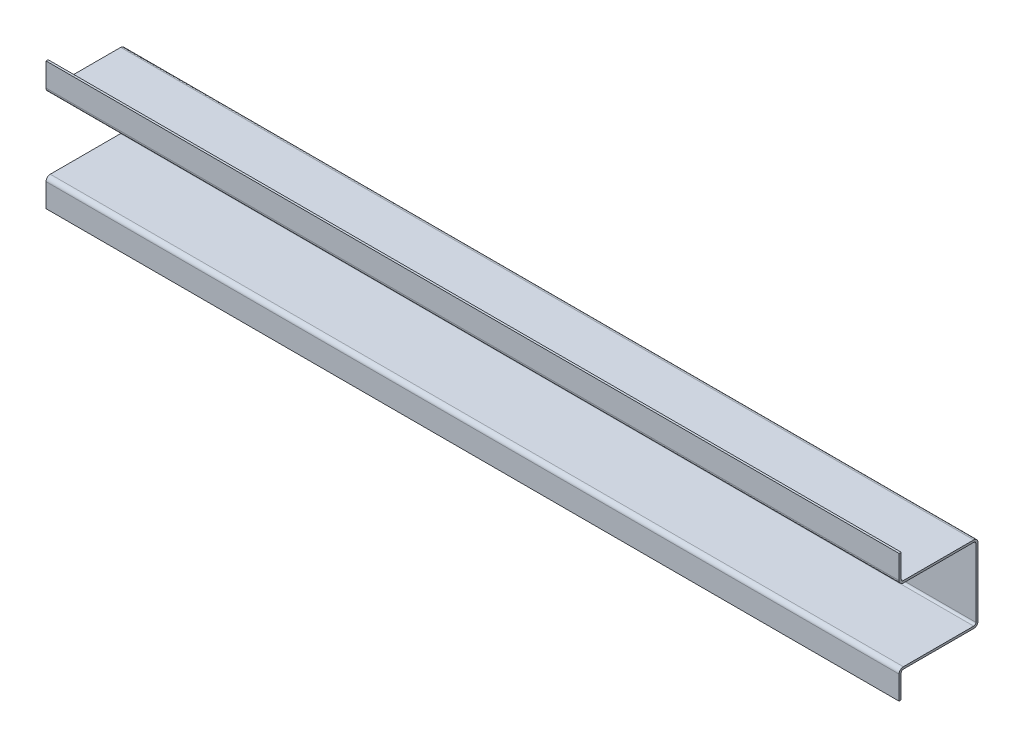
ISO-10303-21;
HEADER;
FILE_DESCRIPTION(('STEP AP214'),'2;1');
FILE_NAME('part.step','',(''),(''),'','','');
FILE_SCHEMA(('AUTOMOTIVE_DESIGN { 1 0 10303 214 1 1 1 1 }'));
ENDSEC;
DATA;
#1=APPLICATION_CONTEXT('core data for automotive mechanical design processes');
#2=APPLICATION_PROTOCOL_DEFINITION('international standard','automotive_design',2000,#1);
#3=PRODUCT_CONTEXT('',#1,'mechanical');
#4=PRODUCT('Part','Part','',(#3));
#5=PRODUCT_RELATED_PRODUCT_CATEGORY('part','',(#4));
#6=PRODUCT_DEFINITION_FORMATION('','',#4);
#7=PRODUCT_DEFINITION_CONTEXT('part definition',#1,'design');
#8=PRODUCT_DEFINITION('design','',#6,#7);
#9=PRODUCT_DEFINITION_SHAPE('','',#8);
#10=(LENGTH_UNIT() NAMED_UNIT(*) SI_UNIT(.MILLI.,.METRE.));
#11=(NAMED_UNIT(*) PLANE_ANGLE_UNIT() SI_UNIT($,.RADIAN.));
#12=(NAMED_UNIT(*) SI_UNIT($,.STERADIAN.) SOLID_ANGLE_UNIT());
#13=UNCERTAINTY_MEASURE_WITH_UNIT(LENGTH_MEASURE(1.E-05),#10,'distance_accuracy_value','');
#14=(GEOMETRIC_REPRESENTATION_CONTEXT(3) GLOBAL_UNCERTAINTY_ASSIGNED_CONTEXT((#13)) GLOBAL_UNIT_ASSIGNED_CONTEXT((#10,
#11,#12)) REPRESENTATION_CONTEXT('',''));
#15=CARTESIAN_POINT('',(0.,0.,0.));
#16=DIRECTION('',(0.,0.,1.));
#17=DIRECTION('',(1.,0.,0.));
#18=AXIS2_PLACEMENT_3D('',#15,#16,#17);
#19=CARTESIAN_POINT('',(-635.,-92.075,3.175));
#20=DIRECTION('',(0.,0.,-1.));
#21=DIRECTION('',(-1.,0.,0.));
#22=AXIS2_PLACEMENT_3D('',#19,#20,#21);
#23=PLANE('',#22);
#24=DIRECTION('',(0.,1.,0.));
#25=VECTOR('',#24,1.);
#26=CARTESIAN_POINT('',(635.,-72.23125,3.175));
#27=LINE('',#26,#25);
#28=CARTESIAN_POINT('',(635.,-92.075,3.175));
#29=VERTEX_POINT('',#28);
#30=CARTESIAN_POINT('',(635.,-57.15,3.175));
#31=VERTEX_POINT('',#30);
#32=EDGE_CURVE('E183',#29,#31,#27,.T.);
#33=ORIENTED_EDGE('',*,*,#32,.T.);
#34=DIRECTION('',(1.,0.,0.));
#35=VECTOR('',#34,1.);
#36=CARTESIAN_POINT('',(-635.,-57.15,3.175));
#37=LINE('',#36,#35);
#38=CARTESIAN_POINT('',(-635.,-57.15,3.175));
#39=VERTEX_POINT('',#38);
#40=EDGE_CURVE('E136',#39,#31,#37,.T.);
#41=ORIENTED_EDGE('',*,*,#40,.F.);
#42=DIRECTION('',(0.,1.,0.));
#43=VECTOR('',#42,1.);
#44=CARTESIAN_POINT('',(-635.,-72.23125,3.175));
#45=LINE('',#44,#43);
#46=CARTESIAN_POINT('',(-635.,-92.075,3.175));
#47=VERTEX_POINT('',#46);
#48=EDGE_CURVE('E176',#47,#39,#45,.T.);
#49=ORIENTED_EDGE('',*,*,#48,.F.);
#50=DIRECTION('',(1.,0.,0.));
#51=VECTOR('',#50,1.);
#52=CARTESIAN_POINT('',(0.,-92.075,3.175));
#53=LINE('',#52,#51);
#54=EDGE_CURVE('E199',#47,#29,#53,.T.);
#55=ORIENTED_EDGE('',*,*,#54,.T.);
#56=EDGE_LOOP('',(#33,#41,#49,#55));
#57=FACE_BOUND('',#56,.T.);
#58=ADVANCED_FACE('F17',(#57),#23,.F.);
#59=CARTESIAN_POINT('',(0.,-92.075,1.5875));
#60=DIRECTION('',(0.,1.,0.));
#61=DIRECTION('',(0.,0.,1.));
#62=AXIS2_PLACEMENT_3D('',#59,#60,#61);
#63=PLANE('',#62);
#64=ORIENTED_EDGE('',*,*,#54,.F.);
#65=DIRECTION('',(0.,0.,1.));
#66=VECTOR('',#65,1.);
#67=CARTESIAN_POINT('',(-635.,-92.075,1.5875));
#68=LINE('',#67,#66);
#69=CARTESIAN_POINT('',(-635.,-92.075,0.));
#70=VERTEX_POINT('',#69);
#71=EDGE_CURVE('E179',#70,#47,#68,.T.);
#72=ORIENTED_EDGE('',*,*,#71,.F.);
#73=DIRECTION('',(-1.,0.,0.));
#74=VECTOR('',#73,1.);
#75=CARTESIAN_POINT('',(-635.,-92.075,0.));
#76=LINE('',#75,#74);
#77=CARTESIAN_POINT('',(635.,-92.075,0.));
#78=VERTEX_POINT('',#77);
#79=EDGE_CURVE('E169',#78,#70,#76,.T.);
#80=ORIENTED_EDGE('',*,*,#79,.F.);
#81=DIRECTION('',(0.,0.,1.));
#82=VECTOR('',#81,1.);
#83=CARTESIAN_POINT('',(635.,-92.075,1.5875));
#84=LINE('',#83,#82);
#85=EDGE_CURVE('E186',#78,#29,#84,.T.);
#86=ORIENTED_EDGE('',*,*,#85,.T.);
#87=EDGE_LOOP('',(#64,#72,#80,#86));
#88=FACE_BOUND('',#87,.T.);
#89=ADVANCED_FACE('F411',(#88),#63,.F.);
#90=CARTESIAN_POINT('',(-635.,-57.15,-3.175));
#91=DIRECTION('',(1.,0.,0.));
#92=DIRECTION('',(0.,0.,-1.));
#93=AXIS2_PLACEMENT_3D('',#90,#91,#92);
#94=CYLINDRICAL_SURFACE('',#93,6.35);
#95=CARTESIAN_POINT('',(635.,-57.15,-3.175));
#96=DIRECTION('',(1.,0.,0.));
#97=DIRECTION('',(0.,0.,-1.));
#98=AXIS2_PLACEMENT_3D('',#95,#96,#97);
#99=CIRCLE('',#98,6.35);
#100=CARTESIAN_POINT('',(635.,-50.8,-3.175));
#101=VERTEX_POINT('',#100);
#102=EDGE_CURVE('E20',#101,#31,#99,.T.);
#103=ORIENTED_EDGE('',*,*,#102,.F.);
#104=DIRECTION('',(1.,0.,0.));
#105=VECTOR('',#104,1.);
#106=CARTESIAN_POINT('',(-635.,-50.8,-3.175));
#107=LINE('',#106,#105);
#108=CARTESIAN_POINT('',(-635.,-50.8,-3.175));
#109=VERTEX_POINT('',#108);
#110=EDGE_CURVE('E134',#101,#109,#107,.F.);
#111=ORIENTED_EDGE('',*,*,#110,.T.);
#112=CARTESIAN_POINT('',(-635.,-57.15,-3.175));
#113=DIRECTION('',(1.,0.,0.));
#114=DIRECTION('',(0.,0.,-1.));
#115=AXIS2_PLACEMENT_3D('',#112,#113,#114);
#116=CIRCLE('',#115,6.35);
#117=EDGE_CURVE('E140',#109,#39,#116,.T.);
#118=ORIENTED_EDGE('',*,*,#117,.T.);
#119=ORIENTED_EDGE('',*,*,#40,.T.);
#120=EDGE_LOOP('',(#103,#111,#118,#119));
#121=FACE_BOUND('',#120,.T.);
#122=ADVANCED_FACE('F132',(#121),#94,.T.);
#123=CARTESIAN_POINT('',(-635.,-92.075,0.));
#124=DIRECTION('',(0.,0.,-1.));
#125=DIRECTION('',(-1.,0.,0.));
#126=AXIS2_PLACEMENT_3D('',#123,#124,#125);
#127=PLANE('',#126);
#128=ORIENTED_EDGE('',*,*,#79,.T.);
#129=DIRECTION('',(0.,1.,0.));
#130=VECTOR('',#129,1.);
#131=CARTESIAN_POINT('',(-635.,-92.075,0.));
#132=LINE('',#131,#130);
#133=CARTESIAN_POINT('',(-635.,-57.15,0.));
#134=VERTEX_POINT('',#133);
#135=EDGE_CURVE('E141',#70,#134,#132,.T.);
#136=ORIENTED_EDGE('',*,*,#135,.T.);
#137=DIRECTION('',(1.,0.,0.));
#138=VECTOR('',#137,1.);
#139=CARTESIAN_POINT('',(-635.,-57.15,0.));
#140=LINE('',#139,#138);
#141=CARTESIAN_POINT('',(635.,-57.15,0.));
#142=VERTEX_POINT('',#141);
#143=EDGE_CURVE('E157',#134,#142,#140,.T.);
#144=ORIENTED_EDGE('',*,*,#143,.T.);
#145=DIRECTION('',(0.,1.,0.));
#146=VECTOR('',#145,1.);
#147=CARTESIAN_POINT('',(635.,-92.075,0.));
#148=LINE('',#147,#146);
#149=EDGE_CURVE('E166',#142,#78,#148,.F.);
#150=ORIENTED_EDGE('',*,*,#149,.T.);
#151=EDGE_LOOP('',(#128,#136,#144,#150));
#152=FACE_BOUND('',#151,.T.);
#153=ADVANCED_FACE('F409',(#152),#127,.T.);
#154=CARTESIAN_POINT('',(-635.,-50.8,0.));
#155=DIRECTION('',(0.,-1.,0.));
#156=DIRECTION('',(0.,0.,-1.));
#157=AXIS2_PLACEMENT_3D('',#154,#155,#156);
#158=PLANE('',#157);
#159=DIRECTION('',(0.,0.,1.));
#160=VECTOR('',#159,1.);
#161=CARTESIAN_POINT('',(635.,-50.8,-55.5625));
#162=LINE('',#161,#160);
#163=CARTESIAN_POINT('',(635.,-50.8,-107.95));
#164=VERTEX_POINT('',#163);
#165=EDGE_CURVE('E145',#101,#164,#162,.F.);
#166=ORIENTED_EDGE('',*,*,#165,.T.);
#167=DIRECTION('',(-1.,0.,0.));
#168=VECTOR('',#167,1.);
#169=CARTESIAN_POINT('',(-635.,-50.8,-107.95));
#170=LINE('',#169,#168);
#171=CARTESIAN_POINT('',(-635.,-50.8,-107.95));
#172=VERTEX_POINT('',#171);
#173=EDGE_CURVE('E250',#164,#172,#170,.T.);
#174=ORIENTED_EDGE('',*,*,#173,.T.);
#175=DIRECTION('',(0.,0.,1.));
#176=VECTOR('',#175,1.);
#177=CARTESIAN_POINT('',(-635.,-50.8,-55.5625));
#178=LINE('',#177,#176);
#179=EDGE_CURVE('E148',#109,#172,#178,.F.);
#180=ORIENTED_EDGE('',*,*,#179,.F.);
#181=ORIENTED_EDGE('',*,*,#110,.F.);
#182=EDGE_LOOP('',(#166,#174,#180,#181));
#183=FACE_BOUND('',#182,.T.);
#184=ADVANCED_FACE('F144',(#183),#158,.F.);
#185=CARTESIAN_POINT('',(-635.,-57.15,-3.175));
#186=DIRECTION('',(1.,0.,0.));
#187=DIRECTION('',(0.,0.,-1.));
#188=AXIS2_PLACEMENT_3D('',#185,#186,#187);
#189=CYLINDRICAL_SURFACE('',#188,3.175);
#190=ORIENTED_EDGE('',*,*,#143,.F.);
#191=CARTESIAN_POINT('',(-635.,-57.15,-3.175));
#192=DIRECTION('',(1.,0.,0.));
#193=DIRECTION('',(0.,0.,-1.));
#194=AXIS2_PLACEMENT_3D('',#191,#192,#193);
#195=CIRCLE('',#194,3.175);
#196=CARTESIAN_POINT('',(-635.,-53.975,-3.175));
#197=VERTEX_POINT('',#196);
#198=EDGE_CURVE('E155',#197,#134,#195,.T.);
#199=ORIENTED_EDGE('',*,*,#198,.F.);
#200=DIRECTION('',(1.,0.,0.));
#201=VECTOR('',#200,1.);
#202=CARTESIAN_POINT('',(-635.,-53.975,-3.175));
#203=LINE('',#202,#201);
#204=CARTESIAN_POINT('',(635.,-53.975,-3.175));
#205=VERTEX_POINT('',#204);
#206=EDGE_CURVE('E160',#205,#197,#203,.F.);
#207=ORIENTED_EDGE('',*,*,#206,.F.);
#208=CARTESIAN_POINT('',(635.,-57.15,-3.175));
#209=DIRECTION('',(1.,0.,0.));
#210=DIRECTION('',(0.,0.,-1.));
#211=AXIS2_PLACEMENT_3D('',#208,#209,#210);
#212=CIRCLE('',#211,3.175);
#213=EDGE_CURVE('E165',#142,#205,#212,.F.);
#214=ORIENTED_EDGE('',*,*,#213,.F.);
#215=EDGE_LOOP('',(#190,#199,#207,#214));
#216=FACE_BOUND('',#215,.T.);
#217=ADVANCED_FACE('F407',(#216),#189,.F.);
#218=CARTESIAN_POINT('',(-635.,-47.625,-107.95));
#219=DIRECTION('',(-1.,0.,0.));
#220=DIRECTION('',(0.,0.,1.));
#221=AXIS2_PLACEMENT_3D('',#218,#219,#220);
#222=CYLINDRICAL_SURFACE('',#221,3.175);
#223=ORIENTED_EDGE('',*,*,#173,.F.);
#224=CARTESIAN_POINT('',(635.,-47.625,-107.95));
#225=DIRECTION('',(-1.,0.,0.));
#226=DIRECTION('',(0.,0.,1.));
#227=AXIS2_PLACEMENT_3D('',#224,#225,#226);
#228=CIRCLE('',#227,3.175);
#229=CARTESIAN_POINT('',(635.,-47.625,-111.125));
#230=VERTEX_POINT('',#229);
#231=EDGE_CURVE('E154',#230,#164,#228,.T.);
#232=ORIENTED_EDGE('',*,*,#231,.F.);
#233=DIRECTION('',(-1.,0.,0.));
#234=VECTOR('',#233,1.);
#235=CARTESIAN_POINT('',(-635.,-47.625,-111.125));
#236=LINE('',#235,#234);
#237=CARTESIAN_POINT('',(-635.,-47.625,-111.125));
#238=VERTEX_POINT('',#237);
#239=EDGE_CURVE('E246',#230,#238,#236,.T.);
#240=ORIENTED_EDGE('',*,*,#239,.T.);
#241=CARTESIAN_POINT('',(-635.,-47.625,-107.95));
#242=DIRECTION('',(-1.,0.,0.));
#243=DIRECTION('',(0.,0.,1.));
#244=AXIS2_PLACEMENT_3D('',#241,#242,#243);
#245=CIRCLE('',#244,3.175);
#246=EDGE_CURVE('E243',#238,#172,#245,.T.);
#247=ORIENTED_EDGE('',*,*,#246,.T.);
#248=EDGE_LOOP('',(#223,#232,#240,#247));
#249=FACE_BOUND('',#248,.T.);
#250=ADVANCED_FACE('F344',(#249),#222,.F.);
#251=CARTESIAN_POINT('',(-635.,-53.975,0.));
#252=DIRECTION('',(0.,-1.,0.));
#253=DIRECTION('',(0.,0.,-1.));
#254=AXIS2_PLACEMENT_3D('',#251,#252,#253);
#255=PLANE('',#254);
#256=ORIENTED_EDGE('',*,*,#206,.T.);
#257=DIRECTION('',(0.,0.,-1.));
#258=VECTOR('',#257,1.);
#259=CARTESIAN_POINT('',(-635.,-53.975,0.));
#260=LINE('',#259,#258);
#261=CARTESIAN_POINT('',(-635.,-53.975,-107.95));
#262=VERTEX_POINT('',#261);
#263=EDGE_CURVE('E247',#197,#262,#260,.T.);
#264=ORIENTED_EDGE('',*,*,#263,.T.);
#265=DIRECTION('',(-1.,0.,0.));
#266=VECTOR('',#265,1.);
#267=CARTESIAN_POINT('',(-635.,-53.975,-107.95));
#268=LINE('',#267,#266);
#269=CARTESIAN_POINT('',(635.,-53.975,-107.95));
#270=VERTEX_POINT('',#269);
#271=EDGE_CURVE('E238',#270,#262,#268,.T.);
#272=ORIENTED_EDGE('',*,*,#271,.F.);
#273=DIRECTION('',(0.,0.,-1.));
#274=VECTOR('',#273,1.);
#275=CARTESIAN_POINT('',(635.,-53.975,0.));
#276=LINE('',#275,#274);
#277=EDGE_CURVE('E249',#270,#205,#276,.F.);
#278=ORIENTED_EDGE('',*,*,#277,.T.);
#279=EDGE_LOOP('',(#256,#264,#272,#278));
#280=FACE_BOUND('',#279,.T.);
#281=ADVANCED_FACE('F402',(#280),#255,.T.);
#282=CARTESIAN_POINT('',(-635.,-53.975,-111.125));
#283=DIRECTION('',(0.,0.,-1.));
#284=DIRECTION('',(-1.,0.,0.));
#285=AXIS2_PLACEMENT_3D('',#282,#283,#284);
#286=PLANE('',#285);
#287=DIRECTION('',(0.,1.,0.));
#288=VECTOR('',#287,1.);
#289=CARTESIAN_POINT('',(635.,3.175,-111.125));
#290=LINE('',#289,#288);
#291=CARTESIAN_POINT('',(635.,53.975,-111.125));
#292=VERTEX_POINT('',#291);
#293=EDGE_CURVE('E242',#230,#292,#290,.T.);
#294=ORIENTED_EDGE('',*,*,#293,.T.);
#295=DIRECTION('',(-1.,0.,0.));
#296=VECTOR('',#295,1.);
#297=CARTESIAN_POINT('',(-635.,53.975,-111.125));
#298=LINE('',#297,#296);
#299=CARTESIAN_POINT('',(-635.,53.975,-111.125));
#300=VERTEX_POINT('',#299);
#301=EDGE_CURVE('E311',#292,#300,#298,.T.);
#302=ORIENTED_EDGE('',*,*,#301,.T.);
#303=DIRECTION('',(0.,1.,0.));
#304=VECTOR('',#303,1.);
#305=CARTESIAN_POINT('',(-635.,3.175,-111.125));
#306=LINE('',#305,#304);
#307=EDGE_CURVE('E237',#238,#300,#306,.T.);
#308=ORIENTED_EDGE('',*,*,#307,.F.);
#309=ORIENTED_EDGE('',*,*,#239,.F.);
#310=EDGE_LOOP('',(#294,#302,#308,#309));
#311=FACE_BOUND('',#310,.T.);
#312=ADVANCED_FACE('F349',(#311),#286,.F.);
#313=CARTESIAN_POINT('',(-635.,60.325,3.175));
#314=DIRECTION('',(0.,0.,-1.));
#315=DIRECTION('',(-1.,0.,0.));
#316=AXIS2_PLACEMENT_3D('',#313,#314,#315);
#317=PLANE('',#316);
#318=DIRECTION('',(0.,1.,0.));
#319=VECTOR('',#318,1.);
#320=CARTESIAN_POINT('',(635.,78.58125,3.175));
#321=LINE('',#320,#319);
#322=CARTESIAN_POINT('',(635.,63.5,3.175));
#323=VERTEX_POINT('',#322);
#324=CARTESIAN_POINT('',(635.,98.425,3.175));
#325=VERTEX_POINT('',#324);
#326=EDGE_CURVE('E321',#323,#325,#321,.T.);
#327=ORIENTED_EDGE('',*,*,#326,.T.);
#328=DIRECTION('',(1.,0.,0.));
#329=VECTOR('',#328,1.);
#330=CARTESIAN_POINT('',(0.,98.425,3.175));
#331=LINE('',#330,#329);
#332=CARTESIAN_POINT('',(-635.,98.425,3.175));
#333=VERTEX_POINT('',#332);
#334=EDGE_CURVE('E323',#333,#325,#331,.T.);
#335=ORIENTED_EDGE('',*,*,#334,.F.);
#336=DIRECTION('',(0.,1.,0.));
#337=VECTOR('',#336,1.);
#338=CARTESIAN_POINT('',(-635.,78.58125,3.175));
#339=LINE('',#338,#337);
#340=CARTESIAN_POINT('',(-635.,63.5,3.175));
#341=VERTEX_POINT('',#340);
#342=EDGE_CURVE('E296',#341,#333,#339,.T.);
#343=ORIENTED_EDGE('',*,*,#342,.F.);
#344=DIRECTION('',(1.,0.,0.));
#345=VECTOR('',#344,1.);
#346=CARTESIAN_POINT('',(-635.,63.5,3.175));
#347=LINE('',#346,#345);
#348=EDGE_CURVE('E292',#323,#341,#347,.F.);
#349=ORIENTED_EDGE('',*,*,#348,.F.);
#350=EDGE_LOOP('',(#327,#335,#343,#349));
#351=FACE_BOUND('',#350,.T.);
#352=ADVANCED_FACE('F383',(#351),#317,.F.);
#353=CARTESIAN_POINT('',(0.,98.425,1.5875));
#354=DIRECTION('',(0.,1.,0.));
#355=DIRECTION('',(0.,0.,1.));
#356=AXIS2_PLACEMENT_3D('',#353,#354,#355);
#357=PLANE('',#356);
#358=DIRECTION('',(0.,0.,1.));
#359=VECTOR('',#358,1.);
#360=CARTESIAN_POINT('',(635.,98.425,1.5875));
#361=LINE('',#360,#359);
#362=CARTESIAN_POINT('',(635.,98.425,0.));
#363=VERTEX_POINT('',#362);
#364=EDGE_CURVE('E287',#325,#363,#361,.F.);
#365=ORIENTED_EDGE('',*,*,#364,.T.);
#366=DIRECTION('',(-1.,0.,0.));
#367=VECTOR('',#366,1.);
#368=CARTESIAN_POINT('',(-635.,98.425,0.));
#369=LINE('',#368,#367);
#370=CARTESIAN_POINT('',(-635.,98.425,0.));
#371=VERTEX_POINT('',#370);
#372=EDGE_CURVE('E280',#371,#363,#369,.F.);
#373=ORIENTED_EDGE('',*,*,#372,.F.);
#374=DIRECTION('',(0.,0.,1.));
#375=VECTOR('',#374,1.);
#376=CARTESIAN_POINT('',(-635.,98.425,1.5875));
#377=LINE('',#376,#375);
#378=EDGE_CURVE('E284',#333,#371,#377,.F.);
#379=ORIENTED_EDGE('',*,*,#378,.F.);
#380=ORIENTED_EDGE('',*,*,#334,.T.);
#381=EDGE_LOOP('',(#365,#373,#379,#380));
#382=FACE_BOUND('',#381,.T.);
#383=ADVANCED_FACE('F282',(#382),#357,.T.);
#384=CARTESIAN_POINT('',(-635.,-47.625,-107.95));
#385=DIRECTION('',(-1.,0.,0.));
#386=DIRECTION('',(0.,0.,1.));
#387=AXIS2_PLACEMENT_3D('',#384,#385,#386);
#388=CYLINDRICAL_SURFACE('',#387,6.35);
#389=CARTESIAN_POINT('',(-635.,-47.625,-107.95));
#390=DIRECTION('',(-1.,0.,0.));
#391=DIRECTION('',(0.,0.,1.));
#392=AXIS2_PLACEMENT_3D('',#389,#390,#391);
#393=CIRCLE('',#392,6.35);
#394=CARTESIAN_POINT('',(-635.,-47.625,-114.3));
#395=VERTEX_POINT('',#394);
#396=EDGE_CURVE('E235',#262,#395,#393,.F.);
#397=ORIENTED_EDGE('',*,*,#396,.T.);
#398=DIRECTION('',(-1.,0.,0.));
#399=VECTOR('',#398,1.);
#400=CARTESIAN_POINT('',(-635.,-47.625,-114.3));
#401=LINE('',#400,#399);
#402=CARTESIAN_POINT('',(635.,-47.625,-114.3));
#403=VERTEX_POINT('',#402);
#404=EDGE_CURVE('E317',#403,#395,#401,.T.);
#405=ORIENTED_EDGE('',*,*,#404,.F.);
#406=CARTESIAN_POINT('',(635.,-47.625,-107.95));
#407=DIRECTION('',(-1.,0.,0.));
#408=DIRECTION('',(0.,0.,1.));
#409=AXIS2_PLACEMENT_3D('',#406,#407,#408);
#410=CIRCLE('',#409,6.35);
#411=EDGE_CURVE('E239',#403,#270,#410,.T.);
#412=ORIENTED_EDGE('',*,*,#411,.T.);
#413=ORIENTED_EDGE('',*,*,#271,.T.);
#414=EDGE_LOOP('',(#397,#405,#412,#413));
#415=FACE_BOUND('',#414,.T.);
#416=ADVANCED_FACE('F400',(#415),#388,.T.);
#417=CARTESIAN_POINT('',(-635.,53.975,-107.95));
#418=DIRECTION('',(-1.,0.,0.));
#419=DIRECTION('',(0.,0.,1.));
#420=AXIS2_PLACEMENT_3D('',#417,#418,#419);
#421=CYLINDRICAL_SURFACE('',#420,3.175);
#422=ORIENTED_EDGE('',*,*,#301,.F.);
#423=CARTESIAN_POINT('',(635.,53.975,-107.95));
#424=DIRECTION('',(-1.,0.,0.));
#425=DIRECTION('',(0.,0.,1.));
#426=AXIS2_PLACEMENT_3D('',#423,#424,#425);
#427=CIRCLE('',#426,3.175);
#428=CARTESIAN_POINT('',(635.,57.15,-107.95));
#429=VERTEX_POINT('',#428);
#430=EDGE_CURVE('E227',#429,#292,#427,.T.);
#431=ORIENTED_EDGE('',*,*,#430,.F.);
#432=DIRECTION('',(1.,0.,0.));
#433=VECTOR('',#432,1.);
#434=CARTESIAN_POINT('',(-635.,57.15,-107.95));
#435=LINE('',#434,#433);
#436=CARTESIAN_POINT('',(-635.,57.15,-107.95));
#437=VERTEX_POINT('',#436);
#438=EDGE_CURVE('E221',#429,#437,#435,.F.);
#439=ORIENTED_EDGE('',*,*,#438,.T.);
#440=CARTESIAN_POINT('',(-635.,53.975,-107.95));
#441=DIRECTION('',(-1.,0.,0.));
#442=DIRECTION('',(0.,0.,1.));
#443=AXIS2_PLACEMENT_3D('',#440,#441,#442);
#444=CIRCLE('',#443,3.175);
#445=EDGE_CURVE('E222',#437,#300,#444,.T.);
#446=ORIENTED_EDGE('',*,*,#445,.T.);
#447=EDGE_LOOP('',(#422,#431,#439,#446));
#448=FACE_BOUND('',#447,.T.);
#449=ADVANCED_FACE('F352',(#448),#421,.F.);
#450=CARTESIAN_POINT('',(-635.,63.5,-3.175));
#451=DIRECTION('',(1.,0.,0.));
#452=DIRECTION('',(0.,0.,-1.));
#453=AXIS2_PLACEMENT_3D('',#450,#451,#452);
#454=CYLINDRICAL_SURFACE('',#453,6.35);
#455=CARTESIAN_POINT('',(635.,63.5,-3.175));
#456=DIRECTION('',(1.,0.,0.));
#457=DIRECTION('',(0.,0.,-1.));
#458=AXIS2_PLACEMENT_3D('',#455,#456,#457);
#459=CIRCLE('',#458,6.35);
#460=CARTESIAN_POINT('',(635.,57.15,-3.175));
#461=VERTEX_POINT('',#460);
#462=EDGE_CURVE('E231',#323,#461,#459,.T.);
#463=ORIENTED_EDGE('',*,*,#462,.F.);
#464=ORIENTED_EDGE('',*,*,#348,.T.);
#465=CARTESIAN_POINT('',(-635.,63.5,-3.175));
#466=DIRECTION('',(1.,0.,0.));
#467=DIRECTION('',(0.,0.,-1.));
#468=AXIS2_PLACEMENT_3D('',#465,#466,#467);
#469=CIRCLE('',#468,6.35);
#470=CARTESIAN_POINT('',(-635.,57.15,-3.175));
#471=VERTEX_POINT('',#470);
#472=EDGE_CURVE('E219',#341,#471,#469,.T.);
#473=ORIENTED_EDGE('',*,*,#472,.T.);
#474=DIRECTION('',(1.,0.,0.));
#475=VECTOR('',#474,1.);
#476=CARTESIAN_POINT('',(-635.,57.15,-3.175));
#477=LINE('',#476,#475);
#478=EDGE_CURVE('E225',#471,#461,#477,.T.);
#479=ORIENTED_EDGE('',*,*,#478,.T.);
#480=EDGE_LOOP('',(#463,#464,#473,#479));
#481=FACE_BOUND('',#480,.T.);
#482=ADVANCED_FACE('F381',(#481),#454,.T.);
#483=CARTESIAN_POINT('',(-635.,60.325,0.));
#484=DIRECTION('',(0.,0.,-1.));
#485=DIRECTION('',(-1.,0.,0.));
#486=AXIS2_PLACEMENT_3D('',#483,#484,#485);
#487=PLANE('',#486);
#488=DIRECTION('',(1.,0.,0.));
#489=VECTOR('',#488,1.);
#490=CARTESIAN_POINT('',(-635.,63.5,0.));
#491=LINE('',#490,#489);
#492=CARTESIAN_POINT('',(635.,63.5,0.));
#493=VERTEX_POINT('',#492);
#494=CARTESIAN_POINT('',(-635.,63.5,0.));
#495=VERTEX_POINT('',#494);
#496=EDGE_CURVE('E218',#493,#495,#491,.F.);
#497=ORIENTED_EDGE('',*,*,#496,.T.);
#498=DIRECTION('',(0.,1.,0.));
#499=VECTOR('',#498,1.);
#500=CARTESIAN_POINT('',(-635.,60.325,0.));
#501=LINE('',#500,#499);
#502=EDGE_CURVE('E234',#495,#371,#501,.T.);
#503=ORIENTED_EDGE('',*,*,#502,.T.);
#504=ORIENTED_EDGE('',*,*,#372,.T.);
#505=DIRECTION('',(0.,1.,0.));
#506=VECTOR('',#505,1.);
#507=CARTESIAN_POINT('',(635.,60.325,0.));
#508=LINE('',#507,#506);
#509=EDGE_CURVE('E291',#363,#493,#508,.F.);
#510=ORIENTED_EDGE('',*,*,#509,.T.);
#511=EDGE_LOOP('',(#497,#503,#504,#510));
#512=FACE_BOUND('',#511,.T.);
#513=ADVANCED_FACE('F298',(#512),#487,.T.);
#514=CARTESIAN_POINT('',(-635.,-53.975,-114.3));
#515=DIRECTION('',(0.,0.,-1.));
#516=DIRECTION('',(-1.,0.,0.));
#517=AXIS2_PLACEMENT_3D('',#514,#515,#516);
#518=PLANE('',#517);
#519=ORIENTED_EDGE('',*,*,#404,.T.);
#520=DIRECTION('',(0.,1.,0.));
#521=VECTOR('',#520,1.);
#522=CARTESIAN_POINT('',(-635.,-53.975,-114.3));
#523=LINE('',#522,#521);
#524=CARTESIAN_POINT('',(-635.,53.975,-114.3));
#525=VERTEX_POINT('',#524);
#526=EDGE_CURVE('E226',#395,#525,#523,.T.);
#527=ORIENTED_EDGE('',*,*,#526,.T.);
#528=DIRECTION('',(-1.,0.,0.));
#529=VECTOR('',#528,1.);
#530=CARTESIAN_POINT('',(-635.,53.975,-114.3));
#531=LINE('',#530,#529);
#532=CARTESIAN_POINT('',(635.,53.975,-114.3));
#533=VERTEX_POINT('',#532);
#534=EDGE_CURVE('E208',#533,#525,#531,.T.);
#535=ORIENTED_EDGE('',*,*,#534,.F.);
#536=DIRECTION('',(0.,1.,0.));
#537=VECTOR('',#536,1.);
#538=CARTESIAN_POINT('',(635.,-53.975,-114.3));
#539=LINE('',#538,#537);
#540=EDGE_CURVE('E230',#533,#403,#539,.F.);
#541=ORIENTED_EDGE('',*,*,#540,.T.);
#542=EDGE_LOOP('',(#519,#527,#535,#541));
#543=FACE_BOUND('',#542,.T.);
#544=ADVANCED_FACE('F394',(#543),#518,.T.);
#545=CARTESIAN_POINT('',(-635.,57.15,-114.3));
#546=DIRECTION('',(0.,1.,0.));
#547=DIRECTION('',(0.,0.,1.));
#548=AXIS2_PLACEMENT_3D('',#545,#546,#547);
#549=PLANE('',#548);
#550=DIRECTION('',(0.,0.,1.));
#551=VECTOR('',#550,1.);
#552=CARTESIAN_POINT('',(635.,57.15,-55.5625));
#553=LINE('',#552,#551);
#554=EDGE_CURVE('E212',#429,#461,#553,.T.);
#555=ORIENTED_EDGE('',*,*,#554,.T.);
#556=ORIENTED_EDGE('',*,*,#478,.F.);
#557=DIRECTION('',(0.,0.,1.));
#558=VECTOR('',#557,1.);
#559=CARTESIAN_POINT('',(-635.,57.15,-55.5625));
#560=LINE('',#559,#558);
#561=EDGE_CURVE('E207',#437,#471,#560,.T.);
#562=ORIENTED_EDGE('',*,*,#561,.F.);
#563=ORIENTED_EDGE('',*,*,#438,.F.);
#564=EDGE_LOOP('',(#555,#556,#562,#563));
#565=FACE_BOUND('',#564,.T.);
#566=ADVANCED_FACE('F358',(#565),#549,.F.);
#567=CARTESIAN_POINT('',(-635.,63.5,-3.175));
#568=DIRECTION('',(1.,0.,0.));
#569=DIRECTION('',(0.,0.,-1.));
#570=AXIS2_PLACEMENT_3D('',#567,#568,#569);
#571=CYLINDRICAL_SURFACE('',#570,3.175);
#572=DIRECTION('',(1.,0.,0.));
#573=VECTOR('',#572,1.);
#574=CARTESIAN_POINT('',(-635.,60.325,-3.175));
#575=LINE('',#574,#573);
#576=CARTESIAN_POINT('',(-635.,60.325,-3.175));
#577=VERTEX_POINT('',#576);
#578=CARTESIAN_POINT('',(635.,60.325,-3.175));
#579=VERTEX_POINT('',#578);
#580=EDGE_CURVE('E360',#577,#579,#575,.T.);
#581=ORIENTED_EDGE('',*,*,#580,.F.);
#582=CARTESIAN_POINT('',(-635.,63.5,-3.175));
#583=DIRECTION('',(1.,0.,0.));
#584=DIRECTION('',(0.,0.,-1.));
#585=AXIS2_PLACEMENT_3D('',#582,#583,#584);
#586=CIRCLE('',#585,3.175);
#587=EDGE_CURVE('E216',#495,#577,#586,.T.);
#588=ORIENTED_EDGE('',*,*,#587,.F.);
#589=ORIENTED_EDGE('',*,*,#496,.F.);
#590=CARTESIAN_POINT('',(635.,63.5,-3.175));
#591=DIRECTION('',(1.,0.,0.));
#592=DIRECTION('',(0.,0.,-1.));
#593=AXIS2_PLACEMENT_3D('',#590,#591,#592);
#594=CIRCLE('',#593,3.175);
#595=EDGE_CURVE('E213',#579,#493,#594,.F.);
#596=ORIENTED_EDGE('',*,*,#595,.F.);
#597=EDGE_LOOP('',(#581,#588,#589,#596));
#598=FACE_BOUND('',#597,.T.);
#599=ADVANCED_FACE('F386',(#598),#571,.F.);
#600=CARTESIAN_POINT('',(635.,58.7375,-55.5625));
#601=DIRECTION('',(-1.,0.,0.));
#602=DIRECTION('',(0.,0.,1.));
#603=AXIS2_PLACEMENT_3D('',#600,#601,#602);
#604=PLANE('',#603);
#605=DIRECTION('',(0.,0.,1.));
#606=VECTOR('',#605,1.);
#607=CARTESIAN_POINT('',(635.,60.325,-114.3));
#608=LINE('',#607,#606);
#609=CARTESIAN_POINT('',(635.,60.325,-107.95));
#610=VERTEX_POINT('',#609);
#611=EDGE_CURVE('E363',#579,#610,#608,.F.);
#612=ORIENTED_EDGE('',*,*,#611,.F.);
#613=ORIENTED_EDGE('',*,*,#595,.T.);
#614=ORIENTED_EDGE('',*,*,#509,.F.);
#615=ORIENTED_EDGE('',*,*,#364,.F.);
#616=ORIENTED_EDGE('',*,*,#326,.F.);
#617=ORIENTED_EDGE('',*,*,#462,.T.);
#618=ORIENTED_EDGE('',*,*,#554,.F.);
#619=ORIENTED_EDGE('',*,*,#430,.T.);
#620=ORIENTED_EDGE('',*,*,#293,.F.);
#621=ORIENTED_EDGE('',*,*,#231,.T.);
#622=ORIENTED_EDGE('',*,*,#165,.F.);
#623=ORIENTED_EDGE('',*,*,#102,.T.);
#624=ORIENTED_EDGE('',*,*,#32,.F.);
#625=ORIENTED_EDGE('',*,*,#85,.F.);
#626=ORIENTED_EDGE('',*,*,#149,.F.);
#627=ORIENTED_EDGE('',*,*,#213,.T.);
#628=ORIENTED_EDGE('',*,*,#277,.F.);
#629=ORIENTED_EDGE('',*,*,#411,.F.);
#630=ORIENTED_EDGE('',*,*,#540,.F.);
#631=CARTESIAN_POINT('',(635.,53.975,-107.95));
#632=DIRECTION('',(-1.,0.,0.));
#633=DIRECTION('',(0.,0.,1.));
#634=AXIS2_PLACEMENT_3D('',#631,#632,#633);
#635=CIRCLE('',#634,6.35);
#636=EDGE_CURVE('E209',#610,#533,#635,.T.);
#637=ORIENTED_EDGE('',*,*,#636,.F.);
#638=EDGE_LOOP('',(#612,#613,#614,#615,#616,#617,#618,#619,#620,#621,#622,#623,#624,#625,#626,
#627,#628,#629,#630,#637));
#639=FACE_BOUND('',#638,.T.);
#640=ADVANCED_FACE('F152',(#639),#604,.F.);
#641=CARTESIAN_POINT('',(-635.,53.975,-107.95));
#642=DIRECTION('',(-1.,0.,0.));
#643=DIRECTION('',(0.,0.,1.));
#644=AXIS2_PLACEMENT_3D('',#641,#642,#643);
#645=CYLINDRICAL_SURFACE('',#644,6.35);
#646=CARTESIAN_POINT('',(-635.,53.975,-107.95));
#647=DIRECTION('',(-1.,0.,0.));
#648=DIRECTION('',(0.,0.,1.));
#649=AXIS2_PLACEMENT_3D('',#646,#647,#648);
#650=CIRCLE('',#649,6.35);
#651=CARTESIAN_POINT('',(-635.,60.325,-107.95));
#652=VERTEX_POINT('',#651);
#653=EDGE_CURVE('E35',#525,#652,#650,.F.);
#654=ORIENTED_EDGE('',*,*,#653,.T.);
#655=DIRECTION('',(1.,0.,0.));
#656=VECTOR('',#655,1.);
#657=CARTESIAN_POINT('',(-635.,60.325,-107.95));
#658=LINE('',#657,#656);
#659=EDGE_CURVE('E26',#610,#652,#658,.F.);
#660=ORIENTED_EDGE('',*,*,#659,.F.);
#661=ORIENTED_EDGE('',*,*,#636,.T.);
#662=ORIENTED_EDGE('',*,*,#534,.T.);
#663=EDGE_LOOP('',(#654,#660,#661,#662));
#664=FACE_BOUND('',#663,.T.);
#665=ADVANCED_FACE('F390',(#664),#645,.T.);
#666=CARTESIAN_POINT('',(-635.,58.7375,-55.5625));
#667=DIRECTION('',(-1.,0.,0.));
#668=DIRECTION('',(0.,0.,1.));
#669=AXIS2_PLACEMENT_3D('',#666,#667,#668);
#670=PLANE('',#669);
#671=ORIENTED_EDGE('',*,*,#561,.T.);
#672=ORIENTED_EDGE('',*,*,#472,.F.);
#673=ORIENTED_EDGE('',*,*,#342,.T.);
#674=ORIENTED_EDGE('',*,*,#378,.T.);
#675=ORIENTED_EDGE('',*,*,#502,.F.);
#676=ORIENTED_EDGE('',*,*,#587,.T.);
#677=DIRECTION('',(0.,0.,1.));
#678=VECTOR('',#677,1.);
#679=CARTESIAN_POINT('',(-635.,60.325,-114.3));
#680=LINE('',#679,#678);
#681=EDGE_CURVE('E11',#652,#577,#680,.T.);
#682=ORIENTED_EDGE('',*,*,#681,.F.);
#683=ORIENTED_EDGE('',*,*,#653,.F.);
#684=ORIENTED_EDGE('',*,*,#526,.F.);
#685=ORIENTED_EDGE('',*,*,#396,.F.);
#686=ORIENTED_EDGE('',*,*,#263,.F.);
#687=ORIENTED_EDGE('',*,*,#198,.T.);
#688=ORIENTED_EDGE('',*,*,#135,.F.);
#689=ORIENTED_EDGE('',*,*,#71,.T.);
#690=ORIENTED_EDGE('',*,*,#48,.T.);
#691=ORIENTED_EDGE('',*,*,#117,.F.);
#692=ORIENTED_EDGE('',*,*,#179,.T.);
#693=ORIENTED_EDGE('',*,*,#246,.F.);
#694=ORIENTED_EDGE('',*,*,#307,.T.);
#695=ORIENTED_EDGE('',*,*,#445,.F.);
#696=EDGE_LOOP('',(#671,#672,#673,#674,#675,#676,#682,#683,#684,#685,#686,#687,#688,#689,#690,
#691,#692,#693,#694,#695));
#697=FACE_BOUND('',#696,.T.);
#698=ADVANCED_FACE('F254',(#697),#670,.T.);
#699=CARTESIAN_POINT('',(-635.,60.325,-114.3));
#700=DIRECTION('',(0.,1.,0.));
#701=DIRECTION('',(0.,0.,1.));
#702=AXIS2_PLACEMENT_3D('',#699,#700,#701);
#703=PLANE('',#702);
#704=ORIENTED_EDGE('',*,*,#659,.T.);
#705=ORIENTED_EDGE('',*,*,#681,.T.);
#706=ORIENTED_EDGE('',*,*,#580,.T.);
#707=ORIENTED_EDGE('',*,*,#611,.T.);
#708=EDGE_LOOP('',(#704,#705,#706,#707));
#709=FACE_BOUND('',#708,.T.);
#710=ADVANCED_FACE('F389',(#709),#703,.T.);
#711=CLOSED_SHELL('',(#58,#89,#122,#153,#184,#217,#250,#281,#312,#352,#383,#416,#449,#482,#513,
#544,#566,#599,#640,#665,#698,#710));
#712=MANIFOLD_SOLID_BREP('B1',#711);
#713=ADVANCED_BREP_SHAPE_REPRESENTATION('',(#18,#712),#14);
#714=SHAPE_DEFINITION_REPRESENTATION(#9,#713);
ENDSEC;
END-ISO-10303-21;
